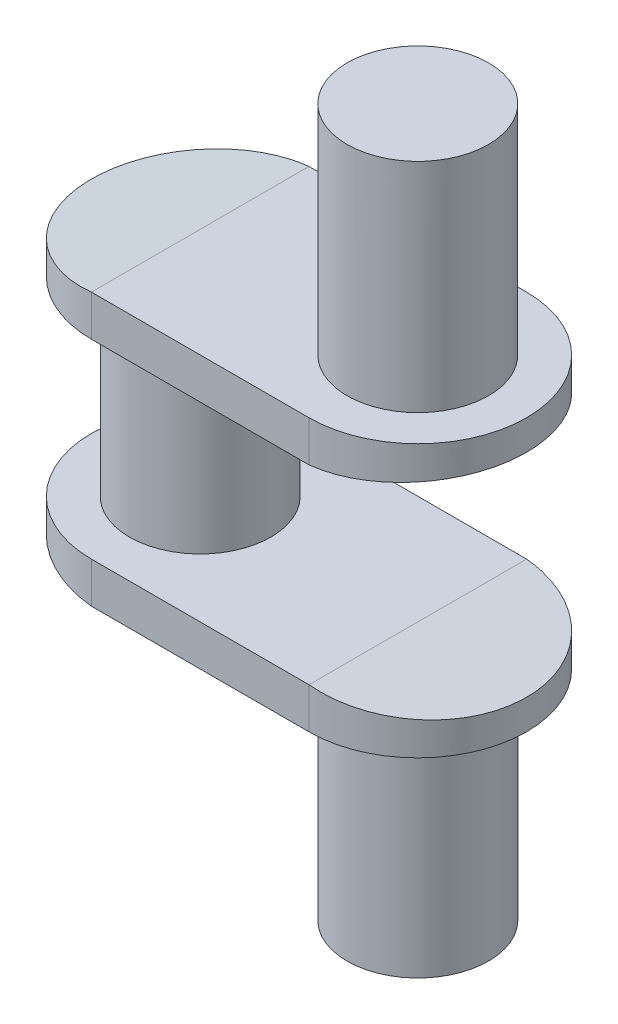
ISO-10303-21;
HEADER;
FILE_DESCRIPTION(('STEP AP214'),'2;1');
FILE_NAME('part.step','',(''),(''),'','','');
FILE_SCHEMA(('AUTOMOTIVE_DESIGN { 1 0 10303 214 1 1 1 1 }'));
ENDSEC;
DATA;
#1=APPLICATION_CONTEXT('core data for automotive mechanical design processes');
#2=APPLICATION_PROTOCOL_DEFINITION('international standard','automotive_design',2000,#1);
#3=PRODUCT_CONTEXT('',#1,'mechanical');
#4=PRODUCT('Part','Part','',(#3));
#5=PRODUCT_RELATED_PRODUCT_CATEGORY('part','',(#4));
#6=PRODUCT_DEFINITION_FORMATION('','',#4);
#7=PRODUCT_DEFINITION_CONTEXT('part definition',#1,'design');
#8=PRODUCT_DEFINITION('design','',#6,#7);
#9=PRODUCT_DEFINITION_SHAPE('','',#8);
#10=(LENGTH_UNIT() NAMED_UNIT(*) SI_UNIT(.MILLI.,.METRE.));
#11=(NAMED_UNIT(*) PLANE_ANGLE_UNIT() SI_UNIT($,.RADIAN.));
#12=(NAMED_UNIT(*) SI_UNIT($,.STERADIAN.) SOLID_ANGLE_UNIT());
#13=UNCERTAINTY_MEASURE_WITH_UNIT(LENGTH_MEASURE(1.E-05),#10,'distance_accuracy_value','');
#14=(GEOMETRIC_REPRESENTATION_CONTEXT(3) GLOBAL_UNCERTAINTY_ASSIGNED_CONTEXT((#13)) GLOBAL_UNIT_ASSIGNED_CONTEXT((#10,
#11,#12)) REPRESENTATION_CONTEXT('',''));
#15=CARTESIAN_POINT('',(0.,0.,0.));
#16=DIRECTION('',(0.,0.,1.));
#17=DIRECTION('',(1.,0.,0.));
#18=AXIS2_PLACEMENT_3D('',#15,#16,#17);
#19=CARTESIAN_POINT('',(0.,-50.,0.));
#20=DIRECTION('',(0.,1.,0.));
#21=DIRECTION('',(0.,0.,1.));
#22=AXIS2_PLACEMENT_3D('',#19,#20,#21);
#23=CYLINDRICAL_SURFACE('',#22,40.);
#24=CARTESIAN_POINT('',(0.,-50.,0.));
#25=DIRECTION('',(-0.099503719020999,-0.995037190209989,0.));
#26=DIRECTION('',(-0.995037190209989,0.099503719020999,0.));
#27=AXIS2_PLACEMENT_3D('',#24,#25,#26);
#28=ELLIPSE('',#27,40.1995024844836,40.);
#29=CARTESIAN_POINT('',(0.,-50.,-40.));
#30=VERTEX_POINT('',#29);
#31=CARTESIAN_POINT('',(0.,-50.,40.));
#32=VERTEX_POINT('',#31);
#33=EDGE_CURVE('E110',#30,#32,#28,.F.);
#34=ORIENTED_EDGE('',*,*,#33,.T.);
#35=DIRECTION('',(0.,1.,0.));
#36=VECTOR('',#35,1.);
#37=CARTESIAN_POINT('',(0.,-50.,40.));
#38=LINE('',#37,#36);
#39=CARTESIAN_POINT('',(0.,-35.,40.));
#40=VERTEX_POINT('',#39);
#41=EDGE_CURVE('E114',#32,#40,#38,.T.);
#42=ORIENTED_EDGE('',*,*,#41,.T.);
#43=CARTESIAN_POINT('',(0.,-35.,0.));
#44=DIRECTION('',(0.,1.,0.));
#45=DIRECTION('',(0.,0.,-1.));
#46=AXIS2_PLACEMENT_3D('',#43,#44,#45);
#47=CIRCLE('',#46,40.);
#48=CARTESIAN_POINT('',(0.,-35.,-40.));
#49=VERTEX_POINT('',#48);
#50=EDGE_CURVE('E148',#49,#40,#47,.T.);
#51=ORIENTED_EDGE('',*,*,#50,.F.);
#52=DIRECTION('',(0.,1.,0.));
#53=VECTOR('',#52,1.);
#54=CARTESIAN_POINT('',(0.,-50.,-40.));
#55=LINE('',#54,#53);
#56=EDGE_CURVE('E116',#30,#49,#55,.T.);
#57=ORIENTED_EDGE('',*,*,#56,.F.);
#58=EDGE_LOOP('',(#34,#42,#51,#57));
#59=FACE_BOUND('',#58,.T.);
#60=ADVANCED_FACE('F35',(#59),#23,.T.);
#61=CARTESIAN_POINT('',(80.,-50.,0.));
#62=DIRECTION('',(0.,1.,0.));
#63=DIRECTION('',(0.,0.,1.));
#64=AXIS2_PLACEMENT_3D('',#61,#62,#63);
#65=CYLINDRICAL_SURFACE('',#64,40.);
#66=DIRECTION('',(0.,1.,0.));
#67=VECTOR('',#66,1.);
#68=CARTESIAN_POINT('',(80.,-50.,-40.));
#69=LINE('',#68,#67);
#70=CARTESIAN_POINT('',(80.,-50.,-40.));
#71=VERTEX_POINT('',#70);
#72=CARTESIAN_POINT('',(80.,-35.,-40.));
#73=VERTEX_POINT('',#72);
#74=EDGE_CURVE('E156',#71,#73,#69,.T.);
#75=ORIENTED_EDGE('',*,*,#74,.T.);
#76=CARTESIAN_POINT('',(80.,-35.,0.));
#77=DIRECTION('',(0.099503719020999,0.995037190209989,0.));
#78=DIRECTION('',(-0.995037190209989,0.099503719020999,0.));
#79=AXIS2_PLACEMENT_3D('',#76,#77,#78);
#80=ELLIPSE('',#79,40.1995024844836,40.);
#81=CARTESIAN_POINT('',(80.,-35.,40.));
#82=VERTEX_POINT('',#81);
#83=EDGE_CURVE('E120',#73,#82,#80,.F.);
#84=ORIENTED_EDGE('',*,*,#83,.T.);
#85=DIRECTION('',(0.,1.,0.));
#86=VECTOR('',#85,1.);
#87=CARTESIAN_POINT('',(80.,-50.,40.));
#88=LINE('',#87,#86);
#89=CARTESIAN_POINT('',(80.,-50.,40.));
#90=VERTEX_POINT('',#89);
#91=EDGE_CURVE('E137',#90,#82,#88,.T.);
#92=ORIENTED_EDGE('',*,*,#91,.F.);
#93=CARTESIAN_POINT('',(80.,-50.,0.));
#94=DIRECTION('',(0.,1.,0.));
#95=DIRECTION('',(0.,0.,-1.));
#96=AXIS2_PLACEMENT_3D('',#93,#94,#95);
#97=CIRCLE('',#96,40.);
#98=EDGE_CURVE('E142',#90,#71,#97,.T.);
#99=ORIENTED_EDGE('',*,*,#98,.T.);
#100=EDGE_LOOP('',(#75,#84,#92,#99));
#101=FACE_BOUND('',#100,.T.);
#102=ADVANCED_FACE('F216',(#101),#65,.T.);
#103=CARTESIAN_POINT('',(0.,-50.,0.));
#104=DIRECTION('',(0.,1.,0.));
#105=DIRECTION('',(0.,0.,-1.));
#106=AXIS2_PLACEMENT_3D('',#103,#104,#105);
#107=PLANE('',#106);
#108=CARTESIAN_POINT('',(80.,-50.,0.));
#109=DIRECTION('',(0.,1.,0.));
#110=DIRECTION('',(0.,0.,1.));
#111=AXIS2_PLACEMENT_3D('',#108,#109,#110);
#112=CIRCLE('',#111,26.);
#113=CARTESIAN_POINT('',(80.,-50.,26.));
#114=VERTEX_POINT('',#113);
#115=EDGE_CURVE('E201',#114,#114,#112,.T.);
#116=ORIENTED_EDGE('',*,*,#115,.T.);
#117=EDGE_LOOP('',(#116));
#118=FACE_BOUND('',#117,.T.);
#119=DIRECTION('',(0.,0.,1.));
#120=VECTOR('',#119,1.);
#121=CARTESIAN_POINT('',(0.,-50.,-40.));
#122=LINE('',#121,#120);
#123=EDGE_CURVE('E122',#30,#32,#122,.T.);
#124=ORIENTED_EDGE('',*,*,#123,.F.);
#125=DIRECTION('',(-1.,0.,0.));
#126=VECTOR('',#125,1.);
#127=CARTESIAN_POINT('',(0.,-50.,-40.));
#128=LINE('',#127,#126);
#129=EDGE_CURVE('E144',#71,#30,#128,.T.);
#130=ORIENTED_EDGE('',*,*,#129,.F.);
#131=ORIENTED_EDGE('',*,*,#98,.F.);
#132=DIRECTION('',(1.,0.,0.));
#133=VECTOR('',#132,1.);
#134=CARTESIAN_POINT('',(0.,-50.,40.));
#135=LINE('',#134,#133);
#136=EDGE_CURVE('E134',#32,#90,#135,.T.);
#137=ORIENTED_EDGE('',*,*,#136,.F.);
#138=EDGE_LOOP('',(#124,#130,#131,#137));
#139=FACE_BOUND('',#138,.T.);
#140=ADVANCED_FACE('F140',(#118,#139),#107,.F.);
#141=CARTESIAN_POINT('',(0.,-35.,0.));
#142=DIRECTION('',(0.,1.,0.));
#143=DIRECTION('',(0.,0.,-1.));
#144=AXIS2_PLACEMENT_3D('',#141,#142,#143);
#145=PLANE('',#144);
#146=CARTESIAN_POINT('',(0.,-35.,0.));
#147=DIRECTION('',(0.,1.,0.));
#148=DIRECTION('',(0.,0.,1.));
#149=AXIS2_PLACEMENT_3D('',#146,#147,#148);
#150=CIRCLE('',#149,26.);
#151=CARTESIAN_POINT('',(0.,-35.,26.));
#152=VERTEX_POINT('',#151);
#153=EDGE_CURVE('E160',#152,#152,#150,.T.);
#154=ORIENTED_EDGE('',*,*,#153,.F.);
#155=EDGE_LOOP('',(#154));
#156=FACE_BOUND('',#155,.T.);
#157=DIRECTION('',(1.,0.,0.));
#158=VECTOR('',#157,1.);
#159=CARTESIAN_POINT('',(0.,-35.,40.));
#160=LINE('',#159,#158);
#161=EDGE_CURVE('E136',#40,#82,#160,.T.);
#162=ORIENTED_EDGE('',*,*,#161,.T.);
#163=DIRECTION('',(0.,0.,1.));
#164=VECTOR('',#163,1.);
#165=CARTESIAN_POINT('',(80.,-35.,-40.));
#166=LINE('',#165,#164);
#167=EDGE_CURVE('E127',#73,#82,#166,.T.);
#168=ORIENTED_EDGE('',*,*,#167,.F.);
#169=DIRECTION('',(-1.,0.,0.));
#170=VECTOR('',#169,1.);
#171=CARTESIAN_POINT('',(0.,-35.,-40.));
#172=LINE('',#171,#170);
#173=EDGE_CURVE('E150',#73,#49,#172,.T.);
#174=ORIENTED_EDGE('',*,*,#173,.T.);
#175=ORIENTED_EDGE('',*,*,#50,.T.);
#176=EDGE_LOOP('',(#162,#168,#174,#175));
#177=FACE_BOUND('',#176,.T.);
#178=ADVANCED_FACE('F188',(#156,#177),#145,.T.);
#179=CARTESIAN_POINT('',(0.,35.,0.));
#180=DIRECTION('',(0.,-1.,0.));
#181=DIRECTION('',(0.,0.,-1.));
#182=AXIS2_PLACEMENT_3D('',#179,#180,#181);
#183=CYLINDRICAL_SURFACE('',#182,26.);
#184=CARTESIAN_POINT('',(0.,35.,0.));
#185=DIRECTION('',(0.,1.,0.));
#186=DIRECTION('',(0.,0.,1.));
#187=AXIS2_PLACEMENT_3D('',#184,#185,#186);
#188=CIRCLE('',#187,26.);
#189=CARTESIAN_POINT('',(0.,35.,26.));
#190=VERTEX_POINT('',#189);
#191=EDGE_CURVE('E44',#190,#190,#188,.T.);
#192=ORIENTED_EDGE('',*,*,#191,.F.);
#193=EDGE_LOOP('',(#192));
#194=FACE_BOUND('',#193,.T.);
#195=ORIENTED_EDGE('',*,*,#153,.T.);
#196=EDGE_LOOP('',(#195));
#197=FACE_BOUND('',#196,.T.);
#198=ADVANCED_FACE('F37',(#194,#197),#183,.T.);
#199=CARTESIAN_POINT('',(0.,50.,0.));
#200=DIRECTION('',(0.,-1.,0.));
#201=DIRECTION('',(0.,0.,-1.));
#202=AXIS2_PLACEMENT_3D('',#199,#200,#201);
#203=CYLINDRICAL_SURFACE('',#202,40.);
#204=CARTESIAN_POINT('',(0.,50.,0.));
#205=DIRECTION('',(0.099503719020999,-0.995037190209989,0.));
#206=DIRECTION('',(-0.995037190209989,-0.099503719020999,0.));
#207=AXIS2_PLACEMENT_3D('',#204,#205,#206);
#208=ELLIPSE('',#207,40.1995024844836,40.);
#209=CARTESIAN_POINT('',(0.,50.,40.));
#210=VERTEX_POINT('',#209);
#211=CARTESIAN_POINT('',(0.,50.,-40.));
#212=VERTEX_POINT('',#211);
#213=EDGE_CURVE('E79',#210,#212,#208,.T.);
#214=ORIENTED_EDGE('',*,*,#213,.T.);
#215=DIRECTION('',(0.,-1.,0.));
#216=VECTOR('',#215,1.);
#217=CARTESIAN_POINT('',(0.,50.,-40.));
#218=LINE('',#217,#216);
#219=CARTESIAN_POINT('',(0.,35.,-40.));
#220=VERTEX_POINT('',#219);
#221=EDGE_CURVE('E166',#212,#220,#218,.T.);
#222=ORIENTED_EDGE('',*,*,#221,.T.);
#223=CARTESIAN_POINT('',(0.,35.,0.));
#224=DIRECTION('',(0.,1.,0.));
#225=DIRECTION('',(0.,0.,-1.));
#226=AXIS2_PLACEMENT_3D('',#223,#224,#225);
#227=CIRCLE('',#226,40.);
#228=CARTESIAN_POINT('',(0.,35.,40.));
#229=VERTEX_POINT('',#228);
#230=EDGE_CURVE('E167',#220,#229,#227,.T.);
#231=ORIENTED_EDGE('',*,*,#230,.T.);
#232=DIRECTION('',(0.,-1.,0.));
#233=VECTOR('',#232,1.);
#234=CARTESIAN_POINT('',(0.,50.,40.));
#235=LINE('',#234,#233);
#236=EDGE_CURVE('E180',#210,#229,#235,.T.);
#237=ORIENTED_EDGE('',*,*,#236,.F.);
#238=EDGE_LOOP('',(#214,#222,#231,#237));
#239=FACE_BOUND('',#238,.T.);
#240=ADVANCED_FACE('F247',(#239),#203,.T.);
#241=CARTESIAN_POINT('',(0.,50.,40.));
#242=DIRECTION('',(0.,0.,-1.));
#243=DIRECTION('',(-1.,0.,0.));
#244=AXIS2_PLACEMENT_3D('',#241,#242,#243);
#245=PLANE('',#244);
#246=DIRECTION('',(1.,0.,0.));
#247=VECTOR('',#246,1.);
#248=CARTESIAN_POINT('',(0.,35.,40.));
#249=LINE('',#248,#247);
#250=CARTESIAN_POINT('',(80.,35.,40.));
#251=VERTEX_POINT('',#250);
#252=EDGE_CURVE('E170',#229,#251,#249,.T.);
#253=ORIENTED_EDGE('',*,*,#252,.T.);
#254=DIRECTION('',(0.,-1.,0.));
#255=VECTOR('',#254,1.);
#256=CARTESIAN_POINT('',(80.,50.,40.));
#257=LINE('',#256,#255);
#258=CARTESIAN_POINT('',(80.,50.,40.));
#259=VERTEX_POINT('',#258);
#260=EDGE_CURVE('E177',#259,#251,#257,.T.);
#261=ORIENTED_EDGE('',*,*,#260,.F.);
#262=DIRECTION('',(1.,0.,0.));
#263=VECTOR('',#262,1.);
#264=CARTESIAN_POINT('',(0.,50.,40.));
#265=LINE('',#264,#263);
#266=EDGE_CURVE('E161',#210,#259,#265,.T.);
#267=ORIENTED_EDGE('',*,*,#266,.F.);
#268=ORIENTED_EDGE('',*,*,#236,.T.);
#269=EDGE_LOOP('',(#253,#261,#267,#268));
#270=FACE_BOUND('',#269,.T.);
#271=ADVANCED_FACE('F244',(#270),#245,.F.);
#272=CARTESIAN_POINT('',(80.,50.,0.));
#273=DIRECTION('',(0.,-1.,0.));
#274=DIRECTION('',(0.,0.,-1.));
#275=AXIS2_PLACEMENT_3D('',#272,#273,#274);
#276=CYLINDRICAL_SURFACE('',#275,40.);
#277=ORIENTED_EDGE('',*,*,#260,.T.);
#278=CARTESIAN_POINT('',(80.,35.,0.));
#279=DIRECTION('',(-0.099503719020999,0.995037190209989,0.));
#280=DIRECTION('',(-0.995037190209989,-0.099503719020999,0.));
#281=AXIS2_PLACEMENT_3D('',#278,#279,#280);
#282=ELLIPSE('',#281,40.1995024844836,40.);
#283=CARTESIAN_POINT('',(80.,35.,-40.));
#284=VERTEX_POINT('',#283);
#285=EDGE_CURVE('E66',#251,#284,#282,.T.);
#286=ORIENTED_EDGE('',*,*,#285,.T.);
#287=DIRECTION('',(0.,-1.,0.));
#288=VECTOR('',#287,1.);
#289=CARTESIAN_POINT('',(80.,50.,-40.));
#290=LINE('',#289,#288);
#291=CARTESIAN_POINT('',(80.,50.,-40.));
#292=VERTEX_POINT('',#291);
#293=EDGE_CURVE('E175',#292,#284,#290,.T.);
#294=ORIENTED_EDGE('',*,*,#293,.F.);
#295=CARTESIAN_POINT('',(80.,50.,0.));
#296=DIRECTION('',(0.,1.,0.));
#297=DIRECTION('',(0.,0.,-1.));
#298=AXIS2_PLACEMENT_3D('',#295,#296,#297);
#299=CIRCLE('',#298,40.);
#300=EDGE_CURVE('E52',#259,#292,#299,.T.);
#301=ORIENTED_EDGE('',*,*,#300,.F.);
#302=EDGE_LOOP('',(#277,#286,#294,#301));
#303=FACE_BOUND('',#302,.T.);
#304=ADVANCED_FACE('F241',(#303),#276,.T.);
#305=CARTESIAN_POINT('',(0.,50.,-40.));
#306=DIRECTION('',(0.,0.,1.));
#307=DIRECTION('',(1.,0.,0.));
#308=AXIS2_PLACEMENT_3D('',#305,#306,#307);
#309=PLANE('',#308);
#310=DIRECTION('',(-1.,0.,0.));
#311=VECTOR('',#310,1.);
#312=CARTESIAN_POINT('',(0.,35.,-40.));
#313=LINE('',#312,#311);
#314=EDGE_CURVE('E73',#284,#220,#313,.T.);
#315=ORIENTED_EDGE('',*,*,#314,.T.);
#316=ORIENTED_EDGE('',*,*,#221,.F.);
#317=DIRECTION('',(-1.,0.,0.));
#318=VECTOR('',#317,1.);
#319=CARTESIAN_POINT('',(0.,50.,-40.));
#320=LINE('',#319,#318);
#321=EDGE_CURVE('E164',#292,#212,#320,.T.);
#322=ORIENTED_EDGE('',*,*,#321,.F.);
#323=ORIENTED_EDGE('',*,*,#293,.T.);
#324=EDGE_LOOP('',(#315,#316,#322,#323));
#325=FACE_BOUND('',#324,.T.);
#326=ADVANCED_FACE('F234',(#325),#309,.F.);
#327=CARTESIAN_POINT('',(0.,50.,0.));
#328=DIRECTION('',(0.,-1.,0.));
#329=DIRECTION('',(0.,0.,-1.));
#330=AXIS2_PLACEMENT_3D('',#327,#328,#329);
#331=PLANE('',#330);
#332=CARTESIAN_POINT('',(80.,50.,0.));
#333=DIRECTION('',(0.,-1.,0.));
#334=DIRECTION('',(0.,0.,-1.));
#335=AXIS2_PLACEMENT_3D('',#332,#333,#334);
#336=CIRCLE('',#335,26.);
#337=CARTESIAN_POINT('',(80.,50.,-26.));
#338=VERTEX_POINT('',#337);
#339=EDGE_CURVE('E11',#338,#338,#336,.F.);
#340=ORIENTED_EDGE('',*,*,#339,.F.);
#341=EDGE_LOOP('',(#340));
#342=FACE_BOUND('',#341,.T.);
#343=ORIENTED_EDGE('',*,*,#321,.T.);
#344=DIRECTION('',(0.,0.,1.));
#345=VECTOR('',#344,1.);
#346=CARTESIAN_POINT('',(0.,50.,-40.));
#347=LINE('',#346,#345);
#348=EDGE_CURVE('E209',#212,#210,#347,.T.);
#349=ORIENTED_EDGE('',*,*,#348,.T.);
#350=ORIENTED_EDGE('',*,*,#266,.T.);
#351=ORIENTED_EDGE('',*,*,#300,.T.);
#352=EDGE_LOOP('',(#343,#349,#350,#351));
#353=FACE_BOUND('',#352,.T.);
#354=ADVANCED_FACE('F231',(#342,#353),#331,.F.);
#355=CARTESIAN_POINT('',(0.,35.,0.));
#356=DIRECTION('',(0.,-1.,0.));
#357=DIRECTION('',(0.,0.,-1.));
#358=AXIS2_PLACEMENT_3D('',#355,#356,#357);
#359=PLANE('',#358);
#360=DIRECTION('',(0.,0.,1.));
#361=VECTOR('',#360,1.);
#362=CARTESIAN_POINT('',(80.,35.,-40.));
#363=LINE('',#362,#361);
#364=EDGE_CURVE('E211',#284,#251,#363,.T.);
#365=ORIENTED_EDGE('',*,*,#364,.T.);
#366=ORIENTED_EDGE('',*,*,#252,.F.);
#367=ORIENTED_EDGE('',*,*,#230,.F.);
#368=ORIENTED_EDGE('',*,*,#314,.F.);
#369=EDGE_LOOP('',(#365,#366,#367,#368));
#370=FACE_BOUND('',#369,.T.);
#371=ORIENTED_EDGE('',*,*,#191,.T.);
#372=EDGE_LOOP('',(#371));
#373=FACE_BOUND('',#372,.T.);
#374=ADVANCED_FACE('F229',(#370,#373),#359,.T.);
#375=CARTESIAN_POINT('',(0.,-50.,-40.));
#376=DIRECTION('',(0.,0.,-1.));
#377=DIRECTION('',(-1.,0.,0.));
#378=AXIS2_PLACEMENT_3D('',#375,#376,#377);
#379=PLANE('',#378);
#380=ORIENTED_EDGE('',*,*,#173,.F.);
#381=ORIENTED_EDGE('',*,*,#74,.F.);
#382=ORIENTED_EDGE('',*,*,#129,.T.);
#383=ORIENTED_EDGE('',*,*,#56,.T.);
#384=EDGE_LOOP('',(#380,#381,#382,#383));
#385=FACE_BOUND('',#384,.T.);
#386=ADVANCED_FACE('F196',(#385),#379,.T.);
#387=CARTESIAN_POINT('',(0.,-50.,40.));
#388=DIRECTION('',(0.,0.,1.));
#389=DIRECTION('',(1.,0.,0.));
#390=AXIS2_PLACEMENT_3D('',#387,#388,#389);
#391=PLANE('',#390);
#392=ORIENTED_EDGE('',*,*,#161,.F.);
#393=ORIENTED_EDGE('',*,*,#41,.F.);
#394=ORIENTED_EDGE('',*,*,#136,.T.);
#395=ORIENTED_EDGE('',*,*,#91,.T.);
#396=EDGE_LOOP('',(#392,#393,#394,#395));
#397=FACE_BOUND('',#396,.T.);
#398=ADVANCED_FACE('F132',(#397),#391,.T.);
#399=CARTESIAN_POINT('',(80.,130.,0.));
#400=DIRECTION('',(0.,-1.,0.));
#401=DIRECTION('',(0.,0.,-1.));
#402=AXIS2_PLACEMENT_3D('',#399,#400,#401);
#403=CYLINDRICAL_SURFACE('',#402,26.);
#404=CARTESIAN_POINT('',(80.,130.,0.));
#405=DIRECTION('',(0.,1.,0.));
#406=DIRECTION('',(0.,0.,1.));
#407=AXIS2_PLACEMENT_3D('',#404,#405,#406);
#408=CIRCLE('',#407,26.);
#409=CARTESIAN_POINT('',(80.,130.,26.));
#410=VERTEX_POINT('',#409);
#411=EDGE_CURVE('E151',#410,#410,#408,.T.);
#412=ORIENTED_EDGE('',*,*,#411,.F.);
#413=EDGE_LOOP('',(#412));
#414=FACE_BOUND('',#413,.T.);
#415=ORIENTED_EDGE('',*,*,#339,.T.);
#416=EDGE_LOOP('',(#415));
#417=FACE_BOUND('',#416,.T.);
#418=ADVANCED_FACE('F284',(#414,#417),#403,.T.);
#419=CARTESIAN_POINT('',(80.,130.,0.));
#420=DIRECTION('',(0.,1.,0.));
#421=DIRECTION('',(0.,0.,1.));
#422=AXIS2_PLACEMENT_3D('',#419,#420,#421);
#423=PLANE('',#422);
#424=ORIENTED_EDGE('',*,*,#411,.T.);
#425=EDGE_LOOP('',(#424));
#426=FACE_BOUND('',#425,.T.);
#427=ADVANCED_FACE('F280',(#426),#423,.T.);
#428=CARTESIAN_POINT('',(80.,-130.,0.));
#429=DIRECTION('',(0.,1.,0.));
#430=DIRECTION('',(0.,0.,1.));
#431=AXIS2_PLACEMENT_3D('',#428,#429,#430);
#432=CYLINDRICAL_SURFACE('',#431,26.);
#433=CARTESIAN_POINT('',(80.,-130.,0.));
#434=DIRECTION('',(0.,1.,0.));
#435=DIRECTION('',(0.,0.,1.));
#436=AXIS2_PLACEMENT_3D('',#433,#434,#435);
#437=CIRCLE('',#436,26.);
#438=CARTESIAN_POINT('',(80.,-130.,26.));
#439=VERTEX_POINT('',#438);
#440=EDGE_CURVE('E200',#439,#439,#437,.T.);
#441=ORIENTED_EDGE('',*,*,#440,.T.);
#442=EDGE_LOOP('',(#441));
#443=FACE_BOUND('',#442,.T.);
#444=ORIENTED_EDGE('',*,*,#115,.F.);
#445=EDGE_LOOP('',(#444));
#446=FACE_BOUND('',#445,.T.);
#447=ADVANCED_FACE('F276',(#443,#446),#432,.T.);
#448=CARTESIAN_POINT('',(80.,-130.,0.));
#449=DIRECTION('',(0.,-1.,0.));
#450=DIRECTION('',(0.,0.,1.));
#451=AXIS2_PLACEMENT_3D('',#448,#449,#450);
#452=PLANE('',#451);
#453=ORIENTED_EDGE('',*,*,#440,.F.);
#454=EDGE_LOOP('',(#453));
#455=FACE_BOUND('',#454,.T.);
#456=ADVANCED_FACE('F273',(#455),#452,.T.);
#457=CARTESIAN_POINT('',(120.,-39.,-40.));
#458=DIRECTION('',(0.099503719020999,0.995037190209989,0.));
#459=DIRECTION('',(-0.995037190209989,0.099503719020999,0.));
#460=AXIS2_PLACEMENT_3D('',#457,#458,#459);
#461=PLANE('',#460);
#462=ORIENTED_EDGE('',*,*,#167,.T.);
#463=ORIENTED_EDGE('',*,*,#83,.F.);
#464=EDGE_LOOP('',(#462,#463));
#465=FACE_BOUND('',#464,.T.);
#466=ADVANCED_FACE('F214',(#465),#461,.T.);
#467=CARTESIAN_POINT('',(-40.,-46.,-40.));
#468=DIRECTION('',(-0.099503719020999,-0.995037190209989,0.));
#469=DIRECTION('',(0.995037190209989,-0.099503719020999,0.));
#470=AXIS2_PLACEMENT_3D('',#467,#468,#469);
#471=PLANE('',#470);
#472=ORIENTED_EDGE('',*,*,#33,.F.);
#473=ORIENTED_EDGE('',*,*,#123,.T.);
#474=EDGE_LOOP('',(#472,#473));
#475=FACE_BOUND('',#474,.T.);
#476=ADVANCED_FACE('F123',(#475),#471,.T.);
#477=CARTESIAN_POINT('',(120.,39.,-40.));
#478=DIRECTION('',(-0.099503719020999,0.995037190209989,0.));
#479=DIRECTION('',(-0.995037190209989,-0.099503719020999,0.));
#480=AXIS2_PLACEMENT_3D('',#477,#478,#479);
#481=PLANE('',#480);
#482=ORIENTED_EDGE('',*,*,#364,.F.);
#483=ORIENTED_EDGE('',*,*,#285,.F.);
#484=EDGE_LOOP('',(#482,#483));
#485=FACE_BOUND('',#484,.T.);
#486=ADVANCED_FACE('F262',(#485),#481,.F.);
#487=CARTESIAN_POINT('',(-40.,46.,-40.));
#488=DIRECTION('',(0.099503719020999,-0.995037190209989,0.));
#489=DIRECTION('',(0.995037190209989,0.099503719020999,0.));
#490=AXIS2_PLACEMENT_3D('',#487,#488,#489);
#491=PLANE('',#490);
#492=ORIENTED_EDGE('',*,*,#213,.F.);
#493=ORIENTED_EDGE('',*,*,#348,.F.);
#494=EDGE_LOOP('',(#492,#493));
#495=FACE_BOUND('',#494,.T.);
#496=ADVANCED_FACE('F257',(#495),#491,.F.);
#497=CLOSED_SHELL('',(#60,#102,#140,#178,#198,#240,#271,#304,#326,#354,#374,#386,#398,#418,#427,
#447,#456,#466,#476,#486,#496));
#498=MANIFOLD_SOLID_BREP('B2',#497);
#499=ADVANCED_BREP_SHAPE_REPRESENTATION('',(#18,#498),#14);
#500=SHAPE_DEFINITION_REPRESENTATION(#9,#499);
ENDSEC;
END-ISO-10303-21;
